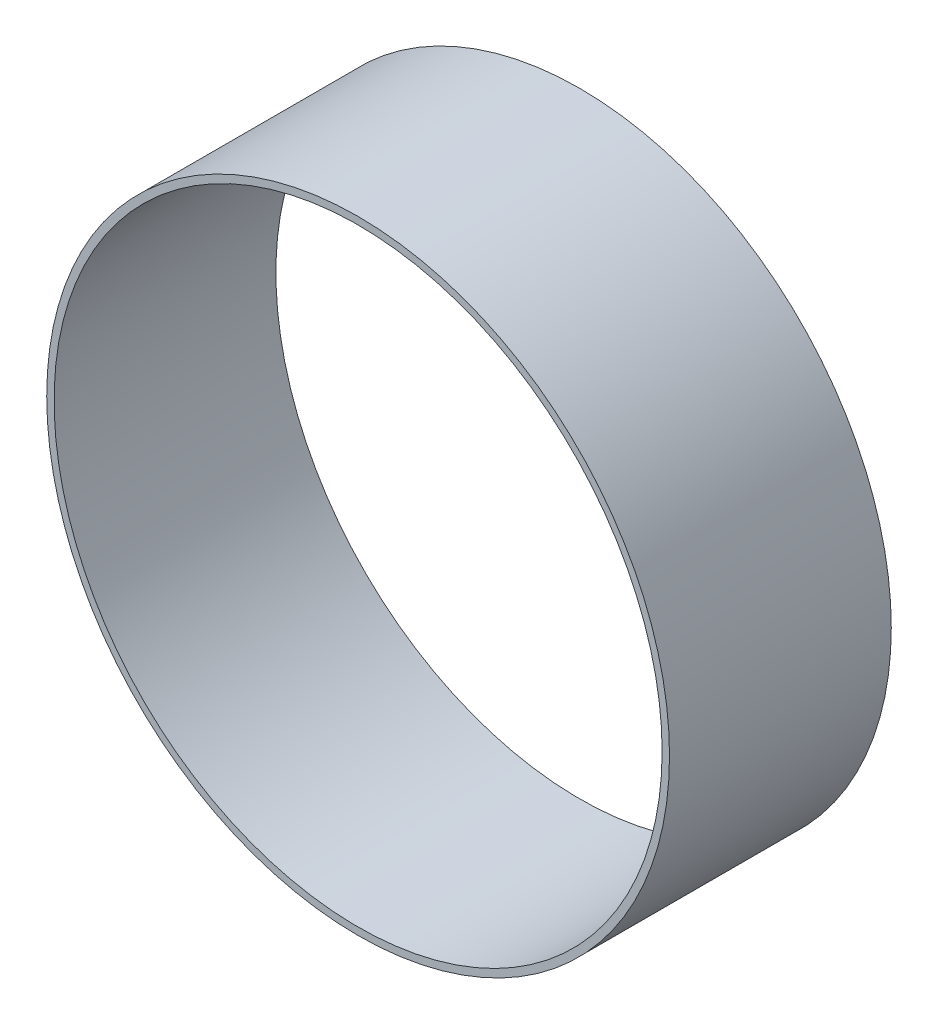
ISO-10303-21;
HEADER;
FILE_DESCRIPTION(('STEP AP214'),'2;1');
FILE_NAME('part.step','',(''),(''),'','','');
FILE_SCHEMA(('AUTOMOTIVE_DESIGN { 1 0 10303 214 1 1 1 1 }'));
ENDSEC;
DATA;
#1=APPLICATION_CONTEXT('core data for automotive mechanical design processes');
#2=APPLICATION_PROTOCOL_DEFINITION('international standard','automotive_design',2000,#1);
#3=PRODUCT_CONTEXT('',#1,'mechanical');
#4=PRODUCT('Part','Part','',(#3));
#5=PRODUCT_RELATED_PRODUCT_CATEGORY('part','',(#4));
#6=PRODUCT_DEFINITION_FORMATION('','',#4);
#7=PRODUCT_DEFINITION_CONTEXT('part definition',#1,'design');
#8=PRODUCT_DEFINITION('design','',#6,#7);
#9=PRODUCT_DEFINITION_SHAPE('','',#8);
#10=(LENGTH_UNIT() NAMED_UNIT(*) SI_UNIT(.MILLI.,.METRE.));
#11=(NAMED_UNIT(*) PLANE_ANGLE_UNIT() SI_UNIT($,.RADIAN.));
#12=(NAMED_UNIT(*) SI_UNIT($,.STERADIAN.) SOLID_ANGLE_UNIT());
#13=UNCERTAINTY_MEASURE_WITH_UNIT(LENGTH_MEASURE(1.E-05),#10,'distance_accuracy_value','');
#14=(GEOMETRIC_REPRESENTATION_CONTEXT(3) GLOBAL_UNCERTAINTY_ASSIGNED_CONTEXT((#13)) GLOBAL_UNIT_ASSIGNED_CONTEXT((#10,
#11,#12)) REPRESENTATION_CONTEXT('',''));
#15=CARTESIAN_POINT('',(0.,0.,0.));
#16=DIRECTION('',(0.,0.,1.));
#17=DIRECTION('',(1.,0.,0.));
#18=AXIS2_PLACEMENT_3D('',#15,#16,#17);
#19=CARTESIAN_POINT('',(0.,0.,6.));
#20=DIRECTION('',(0.,0.,1.));
#21=DIRECTION('',(1.,0.,0.));
#22=AXIS2_PLACEMENT_3D('',#19,#20,#21);
#23=PLANE('',#22);
#24=CARTESIAN_POINT('',(0.,0.,6.));
#25=DIRECTION('',(0.,0.,1.));
#26=DIRECTION('',(1.,0.,0.));
#27=AXIS2_PLACEMENT_3D('',#24,#25,#26);
#28=CIRCLE('',#27,8.425);
#29=CARTESIAN_POINT('',(8.425,0.,6.));
#30=VERTEX_POINT('',#29);
#31=EDGE_CURVE('E10',#30,#30,#28,.T.);
#32=ORIENTED_EDGE('',*,*,#31,.T.);
#33=EDGE_LOOP('',(#32));
#34=FACE_BOUND('',#33,.T.);
#35=CARTESIAN_POINT('',(0.,0.,6.));
#36=DIRECTION('',(0.,0.,1.));
#37=DIRECTION('',(1.,0.,0.));
#38=AXIS2_PLACEMENT_3D('',#35,#36,#37);
#39=CIRCLE('',#38,8.225);
#40=CARTESIAN_POINT('',(8.225,0.,6.));
#41=VERTEX_POINT('',#40);
#42=EDGE_CURVE('E46',#41,#41,#39,.T.);
#43=ORIENTED_EDGE('',*,*,#42,.F.);
#44=EDGE_LOOP('',(#43));
#45=FACE_BOUND('',#44,.T.);
#46=ADVANCED_FACE('F35',(#34,#45),#23,.T.);
#47=CARTESIAN_POINT('',(0.,0.,0.));
#48=DIRECTION('',(0.,0.,1.));
#49=DIRECTION('',(1.,0.,0.));
#50=AXIS2_PLACEMENT_3D('',#47,#48,#49);
#51=PLANE('',#50);
#52=CARTESIAN_POINT('',(0.,0.,0.));
#53=DIRECTION('',(0.,0.,1.));
#54=DIRECTION('',(1.,0.,0.));
#55=AXIS2_PLACEMENT_3D('',#52,#53,#54);
#56=CIRCLE('',#55,8.425);
#57=CARTESIAN_POINT('',(8.425,0.,0.));
#58=VERTEX_POINT('',#57);
#59=EDGE_CURVE('E39',#58,#58,#56,.T.);
#60=ORIENTED_EDGE('',*,*,#59,.F.);
#61=EDGE_LOOP('',(#60));
#62=FACE_BOUND('',#61,.T.);
#63=CARTESIAN_POINT('',(0.,0.,0.));
#64=DIRECTION('',(0.,0.,1.));
#65=DIRECTION('',(1.,0.,0.));
#66=AXIS2_PLACEMENT_3D('',#63,#64,#65);
#67=CIRCLE('',#66,8.225);
#68=CARTESIAN_POINT('',(8.225,0.,0.));
#69=VERTEX_POINT('',#68);
#70=EDGE_CURVE('E48',#69,#69,#67,.T.);
#71=ORIENTED_EDGE('',*,*,#70,.T.);
#72=EDGE_LOOP('',(#71));
#73=FACE_BOUND('',#72,.T.);
#74=ADVANCED_FACE('F58',(#62,#73),#51,.F.);
#75=CARTESIAN_POINT('',(0.,0.,6.));
#76=DIRECTION('',(0.,0.,-1.));
#77=DIRECTION('',(-1.,0.,0.));
#78=AXIS2_PLACEMENT_3D('',#75,#76,#77);
#79=CYLINDRICAL_SURFACE('',#78,8.425);
#80=ORIENTED_EDGE('',*,*,#31,.F.);
#81=EDGE_LOOP('',(#80));
#82=FACE_BOUND('',#81,.T.);
#83=ORIENTED_EDGE('',*,*,#59,.T.);
#84=EDGE_LOOP('',(#83));
#85=FACE_BOUND('',#84,.T.);
#86=ADVANCED_FACE('F37',(#82,#85),#79,.T.);
#87=CARTESIAN_POINT('',(0.,0.,6.));
#88=DIRECTION('',(0.,0.,-1.));
#89=DIRECTION('',(-1.,0.,0.));
#90=AXIS2_PLACEMENT_3D('',#87,#88,#89);
#91=CYLINDRICAL_SURFACE('',#90,8.225);
#92=ORIENTED_EDGE('',*,*,#42,.T.);
#93=EDGE_LOOP('',(#92));
#94=FACE_BOUND('',#93,.T.);
#95=ORIENTED_EDGE('',*,*,#70,.F.);
#96=EDGE_LOOP('',(#95));
#97=FACE_BOUND('',#96,.T.);
#98=ADVANCED_FACE('F54',(#94,#97),#91,.F.);
#99=CLOSED_SHELL('',(#46,#74,#86,#98));
#100=MANIFOLD_SOLID_BREP('B2',#99);
#101=ADVANCED_BREP_SHAPE_REPRESENTATION('',(#18,#100),#14);
#102=SHAPE_DEFINITION_REPRESENTATION(#9,#101);
ENDSEC;
END-ISO-10303-21;
